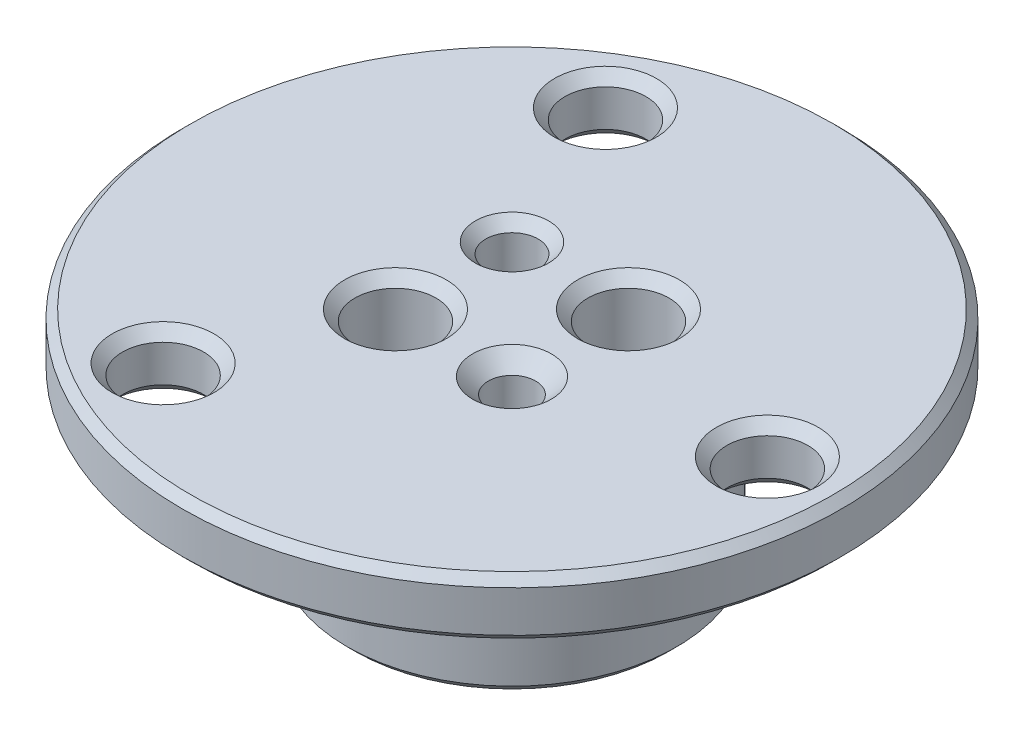
ISO-10303-21;
HEADER;
FILE_DESCRIPTION(('STEP AP214'),'2;1');
FILE_NAME('part.step','',(''),(''),'','','');
FILE_SCHEMA(('AUTOMOTIVE_DESIGN { 1 0 10303 214 1 1 1 1 }'));
ENDSEC;
DATA;
#1=APPLICATION_CONTEXT('core data for automotive mechanical design processes');
#2=APPLICATION_PROTOCOL_DEFINITION('international standard','automotive_design',2000,#1);
#3=PRODUCT_CONTEXT('',#1,'mechanical');
#4=PRODUCT('Part','Part','',(#3));
#5=PRODUCT_RELATED_PRODUCT_CATEGORY('part','',(#4));
#6=PRODUCT_DEFINITION_FORMATION('','',#4);
#7=PRODUCT_DEFINITION_CONTEXT('part definition',#1,'design');
#8=PRODUCT_DEFINITION('design','',#6,#7);
#9=PRODUCT_DEFINITION_SHAPE('','',#8);
#10=(LENGTH_UNIT() NAMED_UNIT(*) SI_UNIT(.MILLI.,.METRE.));
#11=(NAMED_UNIT(*) PLANE_ANGLE_UNIT() SI_UNIT($,.RADIAN.));
#12=(NAMED_UNIT(*) SI_UNIT($,.STERADIAN.) SOLID_ANGLE_UNIT());
#13=UNCERTAINTY_MEASURE_WITH_UNIT(LENGTH_MEASURE(1.E-05),#10,'distance_accuracy_value','');
#14=(GEOMETRIC_REPRESENTATION_CONTEXT(3) GLOBAL_UNCERTAINTY_ASSIGNED_CONTEXT((#13)) GLOBAL_UNIT_ASSIGNED_CONTEXT((#10,
#11,#12)) REPRESENTATION_CONTEXT('',''));
#15=CARTESIAN_POINT('',(0.,0.,0.));
#16=DIRECTION('',(0.,0.,1.));
#17=DIRECTION('',(1.,0.,0.));
#18=AXIS2_PLACEMENT_3D('',#15,#16,#17);
#19=CARTESIAN_POINT('',(0.,0.,-10.));
#20=DIRECTION('',(0.,1.,0.));
#21=DIRECTION('',(0.,0.,1.));
#22=AXIS2_PLACEMENT_3D('',#19,#20,#21);
#23=PLANE('',#22);
#24=CARTESIAN_POINT('',(0.,0.,0.));
#25=DIRECTION('',(0.,1.,0.));
#26=DIRECTION('',(0.,0.,1.));
#27=AXIS2_PLACEMENT_3D('',#24,#25,#26);
#28=CIRCLE('',#27,9.5);
#29=CARTESIAN_POINT('',(0.,0.,9.5));
#30=VERTEX_POINT('',#29);
#31=EDGE_CURVE('E58',#30,#30,#28,.F.);
#32=ORIENTED_EDGE('',*,*,#31,.T.);
#33=EDGE_LOOP('',(#32));
#34=FACE_BOUND('',#33,.T.);
#35=CARTESIAN_POINT('',(3.53553390593274,0.,3.53553390593274));
#36=DIRECTION('',(0.,1.,0.));
#37=DIRECTION('',(0.,0.,1.));
#38=AXIS2_PLACEMENT_3D('',#35,#36,#37);
#39=CIRCLE('',#38,2.3876);
#40=CARTESIAN_POINT('',(3.53553390593274,0.,5.92313390593274));
#41=VERTEX_POINT('',#40);
#42=EDGE_CURVE('E136',#41,#41,#39,.T.);
#43=ORIENTED_EDGE('',*,*,#42,.T.);
#44=EDGE_LOOP('',(#43));
#45=FACE_BOUND('',#44,.T.);
#46=CARTESIAN_POINT('',(-3.53553390593274,0.,-3.53553390593274));
#47=DIRECTION('',(0.,1.,0.));
#48=DIRECTION('',(0.,0.,1.));
#49=AXIS2_PLACEMENT_3D('',#46,#47,#48);
#50=CIRCLE('',#49,2.2225);
#51=CARTESIAN_POINT('',(-3.53553390593274,0.,-1.31303390593274));
#52=VERTEX_POINT('',#51);
#53=EDGE_CURVE('E88',#52,#52,#50,.T.);
#54=ORIENTED_EDGE('',*,*,#53,.T.);
#55=EDGE_LOOP('',(#54));
#56=FACE_BOUND('',#55,.T.);
#57=CARTESIAN_POINT('',(3.53553390593274,0.,-3.53553390593274));
#58=DIRECTION('',(0.,1.,0.));
#59=DIRECTION('',(0.,0.,1.));
#60=AXIS2_PLACEMENT_3D('',#57,#58,#59);
#61=CIRCLE('',#60,3.09245);
#62=CARTESIAN_POINT('',(3.53553390593274,0.,-0.443083905932741));
#63=VERTEX_POINT('',#62);
#64=EDGE_CURVE('E76',#63,#63,#61,.T.);
#65=ORIENTED_EDGE('',*,*,#64,.T.);
#66=EDGE_LOOP('',(#65));
#67=FACE_BOUND('',#66,.T.);
#68=CARTESIAN_POINT('',(-3.53553390593274,0.,3.53553390593274));
#69=DIRECTION('',(0.,1.,0.));
#70=DIRECTION('',(0.,0.,1.));
#71=AXIS2_PLACEMENT_3D('',#68,#69,#70);
#72=CIRCLE('',#71,3.09245);
#73=CARTESIAN_POINT('',(-3.53553390593274,0.,6.62798390593274));
#74=VERTEX_POINT('',#73);
#75=EDGE_CURVE('E64',#74,#74,#72,.T.);
#76=ORIENTED_EDGE('',*,*,#75,.T.);
#77=EDGE_LOOP('',(#76));
#78=FACE_BOUND('',#77,.T.);
#79=ADVANCED_FACE('F32',(#34,#45,#56,#67,#78),#23,.F.);
#80=CARTESIAN_POINT('',(0.,13.2432806,0.));
#81=DIRECTION('',(0.,-1.,0.));
#82=DIRECTION('',(0.,0.,-1.));
#83=AXIS2_PLACEMENT_3D('',#80,#81,#82);
#84=PLANE('',#83);
#85=CARTESIAN_POINT('',(0.,13.2432806,0.));
#86=DIRECTION('',(0.,-1.,0.));
#87=DIRECTION('',(0.,0.,-1.));
#88=AXIS2_PLACEMENT_3D('',#85,#86,#87);
#89=CIRCLE('',#88,19.5);
#90=CARTESIAN_POINT('',(0.,13.2432806,-19.5));
#91=VERTEX_POINT('',#90);
#92=EDGE_CURVE('E43',#91,#91,#89,.F.);
#93=ORIENTED_EDGE('',*,*,#92,.T.);
#94=EDGE_LOOP('',(#93));
#95=FACE_BOUND('',#94,.T.);
#96=CARTESIAN_POINT('',(3.53553390593274,13.2432806,3.53553390593274));
#97=DIRECTION('',(0.,1.,0.));
#98=DIRECTION('',(0.,0.,1.));
#99=AXIS2_PLACEMENT_3D('',#96,#97,#98);
#100=CIRCLE('',#99,2.3876);
#101=CARTESIAN_POINT('',(3.53553390593274,13.2432806,5.92313390593274));
#102=VERTEX_POINT('',#101);
#103=EDGE_CURVE('E145',#102,#102,#100,.T.);
#104=ORIENTED_EDGE('',*,*,#103,.F.);
#105=EDGE_LOOP('',(#104));
#106=FACE_BOUND('',#105,.T.);
#107=CARTESIAN_POINT('',(-7.75000000000006,13.2432806,-13.4233937586588));
#108=DIRECTION('',(0.,1.,0.));
#109=DIRECTION('',(0.,0.,1.));
#110=AXIS2_PLACEMENT_3D('',#107,#108,#109);
#111=CIRCLE('',#110,3.09245);
#112=CARTESIAN_POINT('',(-7.75000000000006,13.2432806,-10.3309437586588));
#113=VERTEX_POINT('',#112);
#114=EDGE_CURVE('E133',#113,#113,#111,.T.);
#115=ORIENTED_EDGE('',*,*,#114,.F.);
#116=EDGE_LOOP('',(#115));
#117=FACE_BOUND('',#116,.T.);
#118=CARTESIAN_POINT('',(15.5,13.2432806,0.));
#119=DIRECTION('',(0.,1.,0.));
#120=DIRECTION('',(0.,0.,1.));
#121=AXIS2_PLACEMENT_3D('',#118,#119,#120);
#122=CIRCLE('',#121,3.09245);
#123=CARTESIAN_POINT('',(15.5,13.2432806,3.09245));
#124=VERTEX_POINT('',#123);
#125=EDGE_CURVE('E121',#124,#124,#122,.T.);
#126=ORIENTED_EDGE('',*,*,#125,.F.);
#127=EDGE_LOOP('',(#126));
#128=FACE_BOUND('',#127,.T.);
#129=CARTESIAN_POINT('',(-7.75000000000006,13.2432806,13.4233937586588));
#130=DIRECTION('',(0.,1.,0.));
#131=DIRECTION('',(0.,0.,1.));
#132=AXIS2_PLACEMENT_3D('',#129,#130,#131);
#133=CIRCLE('',#132,3.09245);
#134=CARTESIAN_POINT('',(-7.75000000000006,13.2432806,16.5158437586588));
#135=VERTEX_POINT('',#134);
#136=EDGE_CURVE('E109',#135,#135,#133,.T.);
#137=ORIENTED_EDGE('',*,*,#136,.F.);
#138=EDGE_LOOP('',(#137));
#139=FACE_BOUND('',#138,.T.);
#140=CARTESIAN_POINT('',(-3.53553390593274,13.2432806,-3.53553390593274));
#141=DIRECTION('',(0.,1.,0.));
#142=DIRECTION('',(0.,0.,1.));
#143=AXIS2_PLACEMENT_3D('',#140,#141,#142);
#144=CIRCLE('',#143,2.2225);
#145=CARTESIAN_POINT('',(-3.53553390593274,13.2432806,-1.31303390593274));
#146=VERTEX_POINT('',#145);
#147=EDGE_CURVE('E97',#146,#146,#144,.T.);
#148=ORIENTED_EDGE('',*,*,#147,.F.);
#149=EDGE_LOOP('',(#148));
#150=FACE_BOUND('',#149,.T.);
#151=CARTESIAN_POINT('',(3.53553390593274,13.2432806,-3.53553390593274));
#152=DIRECTION('',(0.,1.,0.));
#153=DIRECTION('',(0.,0.,1.));
#154=AXIS2_PLACEMENT_3D('',#151,#152,#153);
#155=CIRCLE('',#154,3.09245);
#156=CARTESIAN_POINT('',(3.53553390593274,13.2432806,-0.443083905932738));
#157=VERTEX_POINT('',#156);
#158=EDGE_CURVE('E85',#157,#157,#155,.T.);
#159=ORIENTED_EDGE('',*,*,#158,.F.);
#160=EDGE_LOOP('',(#159));
#161=FACE_BOUND('',#160,.T.);
#162=CARTESIAN_POINT('',(-3.53553390593274,13.2432806,3.53553390593274));
#163=DIRECTION('',(0.,1.,0.));
#164=DIRECTION('',(0.,0.,1.));
#165=AXIS2_PLACEMENT_3D('',#162,#163,#164);
#166=CIRCLE('',#165,3.09245);
#167=CARTESIAN_POINT('',(-3.53553390593274,13.2432806,6.62798390593274));
#168=VERTEX_POINT('',#167);
#169=EDGE_CURVE('E73',#168,#168,#166,.T.);
#170=ORIENTED_EDGE('',*,*,#169,.F.);
#171=EDGE_LOOP('',(#170));
#172=FACE_BOUND('',#171,.T.);
#173=ADVANCED_FACE('F151',(#95,#106,#117,#128,#139,#150,#161,#172),#84,.F.);
#174=CARTESIAN_POINT('',(0.,0.,0.));
#175=DIRECTION('',(0.,1.,0.));
#176=DIRECTION('',(0.,0.,1.));
#177=AXIS2_PLACEMENT_3D('',#174,#175,#176);
#178=CYLINDRICAL_SURFACE('',#177,20.);
#179=CARTESIAN_POINT('',(0.,10.2432806,0.));
#180=DIRECTION('',(0.,1.,0.));
#181=DIRECTION('',(0.,0.,1.));
#182=AXIS2_PLACEMENT_3D('',#179,#180,#181);
#183=CIRCLE('',#182,20.);
#184=CARTESIAN_POINT('',(0.,10.2432806,20.));
#185=VERTEX_POINT('',#184);
#186=EDGE_CURVE('E52',#185,#185,#183,.T.);
#187=ORIENTED_EDGE('',*,*,#186,.T.);
#188=EDGE_LOOP('',(#187));
#189=FACE_BOUND('',#188,.T.);
#190=CARTESIAN_POINT('',(0.,12.7432806,0.));
#191=DIRECTION('',(0.,-1.,0.));
#192=DIRECTION('',(0.,0.,-1.));
#193=AXIS2_PLACEMENT_3D('',#190,#191,#192);
#194=CIRCLE('',#193,20.);
#195=CARTESIAN_POINT('',(0.,12.7432806,-20.));
#196=VERTEX_POINT('',#195);
#197=EDGE_CURVE('E55',#196,#196,#194,.T.);
#198=ORIENTED_EDGE('',*,*,#197,.T.);
#199=EDGE_LOOP('',(#198));
#200=FACE_BOUND('',#199,.T.);
#201=ADVANCED_FACE('F154',(#189,#200),#178,.T.);
#202=CARTESIAN_POINT('',(0.,9.7432806,-20.));
#203=DIRECTION('',(0.,1.,0.));
#204=DIRECTION('',(0.,0.,1.));
#205=AXIS2_PLACEMENT_3D('',#202,#203,#204);
#206=PLANE('',#205);
#207=CARTESIAN_POINT('',(0.,9.7432806,0.));
#208=DIRECTION('',(0.,1.,0.));
#209=DIRECTION('',(0.,0.,1.));
#210=AXIS2_PLACEMENT_3D('',#207,#208,#209);
#211=CIRCLE('',#210,10.5);
#212=CARTESIAN_POINT('',(0.,9.7432806,10.5));
#213=VERTEX_POINT('',#212);
#214=EDGE_CURVE('E39',#213,#213,#211,.T.);
#215=ORIENTED_EDGE('',*,*,#214,.T.);
#216=EDGE_LOOP('',(#215));
#217=FACE_BOUND('',#216,.T.);
#218=CARTESIAN_POINT('',(0.,9.7432806,0.));
#219=DIRECTION('',(0.,1.,0.));
#220=DIRECTION('',(0.,0.,1.));
#221=AXIS2_PLACEMENT_3D('',#218,#219,#220);
#222=CIRCLE('',#221,19.5);
#223=CARTESIAN_POINT('',(0.,9.7432806,19.5));
#224=VERTEX_POINT('',#223);
#225=EDGE_CURVE('E47',#224,#224,#222,.F.);
#226=ORIENTED_EDGE('',*,*,#225,.T.);
#227=EDGE_LOOP('',(#226));
#228=FACE_BOUND('',#227,.T.);
#229=CARTESIAN_POINT('',(-7.75000000000006,9.7432806,-13.4233937586588));
#230=DIRECTION('',(0.,1.,0.));
#231=DIRECTION('',(0.,0.,1.));
#232=AXIS2_PLACEMENT_3D('',#229,#230,#231);
#233=CIRCLE('',#232,3.0861);
#234=CARTESIAN_POINT('',(-7.75000000000006,9.7432806,-10.3372937586588));
#235=VERTEX_POINT('',#234);
#236=EDGE_CURVE('E124',#235,#235,#233,.T.);
#237=ORIENTED_EDGE('',*,*,#236,.T.);
#238=EDGE_LOOP('',(#237));
#239=FACE_BOUND('',#238,.T.);
#240=CARTESIAN_POINT('',(15.5,9.7432806,0.));
#241=DIRECTION('',(0.,1.,0.));
#242=DIRECTION('',(0.,0.,1.));
#243=AXIS2_PLACEMENT_3D('',#240,#241,#242);
#244=CIRCLE('',#243,3.0861);
#245=CARTESIAN_POINT('',(15.5,9.7432806,3.0861));
#246=VERTEX_POINT('',#245);
#247=EDGE_CURVE('E112',#246,#246,#244,.T.);
#248=ORIENTED_EDGE('',*,*,#247,.T.);
#249=EDGE_LOOP('',(#248));
#250=FACE_BOUND('',#249,.T.);
#251=CARTESIAN_POINT('',(-7.75000000000006,9.7432806,13.4233937586588));
#252=DIRECTION('',(0.,1.,0.));
#253=DIRECTION('',(0.,0.,1.));
#254=AXIS2_PLACEMENT_3D('',#251,#252,#253);
#255=CIRCLE('',#254,3.0861);
#256=CARTESIAN_POINT('',(-7.75000000000006,9.7432806,16.5094937586588));
#257=VERTEX_POINT('',#256);
#258=EDGE_CURVE('E100',#257,#257,#255,.T.);
#259=ORIENTED_EDGE('',*,*,#258,.T.);
#260=EDGE_LOOP('',(#259));
#261=FACE_BOUND('',#260,.T.);
#262=ADVANCED_FACE('F213',(#217,#228,#239,#250,#261),#206,.F.);
#263=CARTESIAN_POINT('',(0.,0.,0.));
#264=DIRECTION('',(0.,1.,0.));
#265=DIRECTION('',(0.,0.,1.));
#266=AXIS2_PLACEMENT_3D('',#263,#264,#265);
#267=CYLINDRICAL_SURFACE('',#266,10.);
#268=CARTESIAN_POINT('',(0.,9.2432806,0.));
#269=DIRECTION('',(0.,1.,0.));
#270=DIRECTION('',(0.,0.,1.));
#271=AXIS2_PLACEMENT_3D('',#268,#269,#270);
#272=CIRCLE('',#271,10.);
#273=CARTESIAN_POINT('',(0.,9.2432806,10.));
#274=VERTEX_POINT('',#273);
#275=EDGE_CURVE('E10',#274,#274,#272,.F.);
#276=ORIENTED_EDGE('',*,*,#275,.T.);
#277=EDGE_LOOP('',(#276));
#278=FACE_BOUND('',#277,.T.);
#279=CARTESIAN_POINT('',(0.,0.499999999999991,0.));
#280=DIRECTION('',(0.,1.,0.));
#281=DIRECTION('',(0.,0.,1.));
#282=AXIS2_PLACEMENT_3D('',#279,#280,#281);
#283=CIRCLE('',#282,10.);
#284=CARTESIAN_POINT('',(0.,0.499999999999991,10.));
#285=VERTEX_POINT('',#284);
#286=EDGE_CURVE('E61',#285,#285,#283,.T.);
#287=ORIENTED_EDGE('',*,*,#286,.T.);
#288=EDGE_LOOP('',(#287));
#289=FACE_BOUND('',#288,.T.);
#290=ADVANCED_FACE('F218',(#278,#289),#267,.T.);
#291=CARTESIAN_POINT('',(-3.53553390593274,0.634999999999997,3.53553390593274));
#292=DIRECTION('',(0.,-1.,0.));
#293=DIRECTION('',(0.,0.,-1.));
#294=AXIS2_PLACEMENT_3D('',#291,#292,#293);
#295=CONICAL_SURFACE('',#294,2.45745,0.785398163397451);
#296=ORIENTED_EDGE('',*,*,#75,.F.);
#297=EDGE_LOOP('',(#296));
#298=FACE_BOUND('',#297,.T.);
#299=CARTESIAN_POINT('',(-3.53553390593274,0.634999999999997,3.53553390593274));
#300=DIRECTION('',(0.,1.,0.));
#301=DIRECTION('',(0.,0.,1.));
#302=AXIS2_PLACEMENT_3D('',#299,#300,#301);
#303=CIRCLE('',#302,2.45745);
#304=CARTESIAN_POINT('',(-3.53553390593274,0.634999999999997,5.99298390593274));
#305=VERTEX_POINT('',#304);
#306=EDGE_CURVE('E67',#305,#305,#303,.T.);
#307=ORIENTED_EDGE('',*,*,#306,.T.);
#308=EDGE_LOOP('',(#307));
#309=FACE_BOUND('',#308,.T.);
#310=ADVANCED_FACE('F182',(#298,#309),#295,.F.);
#311=CARTESIAN_POINT('',(-3.53553390593274,13.2432806,3.53553390593274));
#312=DIRECTION('',(0.,1.,0.));
#313=DIRECTION('',(0.,0.,1.));
#314=AXIS2_PLACEMENT_3D('',#311,#312,#313);
#315=CYLINDRICAL_SURFACE('',#314,2.45744999999999);
#316=ORIENTED_EDGE('',*,*,#306,.F.);
#317=EDGE_LOOP('',(#316));
#318=FACE_BOUND('',#317,.T.);
#319=CARTESIAN_POINT('',(-3.53553390593274,12.6082806,3.53553390593274));
#320=DIRECTION('',(0.,1.,0.));
#321=DIRECTION('',(0.,0.,1.));
#322=AXIS2_PLACEMENT_3D('',#319,#320,#321);
#323=CIRCLE('',#322,2.45744999999999);
#324=CARTESIAN_POINT('',(-3.53553390593274,12.6082806,5.99298390593273));
#325=VERTEX_POINT('',#324);
#326=EDGE_CURVE('E70',#325,#325,#323,.T.);
#327=ORIENTED_EDGE('',*,*,#326,.T.);
#328=EDGE_LOOP('',(#327));
#329=FACE_BOUND('',#328,.T.);
#330=ADVANCED_FACE('F172',(#318,#329),#315,.F.);
#331=CARTESIAN_POINT('',(-3.53553390593274,13.2432806,3.53553390593274));
#332=DIRECTION('',(0.,1.,0.));
#333=DIRECTION('',(0.,0.,1.));
#334=AXIS2_PLACEMENT_3D('',#331,#332,#333);
#335=CONICAL_SURFACE('',#334,3.09245,0.785398163397448);
#336=ORIENTED_EDGE('',*,*,#326,.F.);
#337=EDGE_LOOP('',(#336));
#338=FACE_BOUND('',#337,.T.);
#339=ORIENTED_EDGE('',*,*,#169,.T.);
#340=EDGE_LOOP('',(#339));
#341=FACE_BOUND('',#340,.T.);
#342=ADVANCED_FACE('F169',(#338,#341),#335,.F.);
#343=CARTESIAN_POINT('',(3.53553390593274,0.634999999999997,-3.53553390593274));
#344=DIRECTION('',(0.,-1.,0.));
#345=DIRECTION('',(0.,0.,-1.));
#346=AXIS2_PLACEMENT_3D('',#343,#344,#345);
#347=CONICAL_SURFACE('',#346,2.45745,0.785398163397451);
#348=ORIENTED_EDGE('',*,*,#64,.F.);
#349=EDGE_LOOP('',(#348));
#350=FACE_BOUND('',#349,.T.);
#351=CARTESIAN_POINT('',(3.53553390593274,0.634999999999997,-3.53553390593274));
#352=DIRECTION('',(0.,1.,0.));
#353=DIRECTION('',(0.,0.,1.));
#354=AXIS2_PLACEMENT_3D('',#351,#352,#353);
#355=CIRCLE('',#354,2.45745);
#356=CARTESIAN_POINT('',(3.53553390593274,0.634999999999997,-1.07808390593274));
#357=VERTEX_POINT('',#356);
#358=EDGE_CURVE('E79',#357,#357,#355,.T.);
#359=ORIENTED_EDGE('',*,*,#358,.T.);
#360=EDGE_LOOP('',(#359));
#361=FACE_BOUND('',#360,.T.);
#362=ADVANCED_FACE('F171',(#350,#361),#347,.F.);
#363=CARTESIAN_POINT('',(3.53553390593274,13.2432806,-3.53553390593274));
#364=DIRECTION('',(0.,1.,0.));
#365=DIRECTION('',(0.,0.,1.));
#366=AXIS2_PLACEMENT_3D('',#363,#364,#365);
#367=CYLINDRICAL_SURFACE('',#366,2.45744999999999);
#368=ORIENTED_EDGE('',*,*,#358,.F.);
#369=EDGE_LOOP('',(#368));
#370=FACE_BOUND('',#369,.T.);
#371=CARTESIAN_POINT('',(3.53553390593274,12.6082806,-3.53553390593274));
#372=DIRECTION('',(0.,1.,0.));
#373=DIRECTION('',(0.,0.,1.));
#374=AXIS2_PLACEMENT_3D('',#371,#372,#373);
#375=CIRCLE('',#374,2.45744999999999);
#376=CARTESIAN_POINT('',(3.53553390593274,12.6082806,-1.07808390593275));
#377=VERTEX_POINT('',#376);
#378=EDGE_CURVE('E82',#377,#377,#375,.T.);
#379=ORIENTED_EDGE('',*,*,#378,.T.);
#380=EDGE_LOOP('',(#379));
#381=FACE_BOUND('',#380,.T.);
#382=ADVANCED_FACE('F179',(#370,#381),#367,.F.);
#383=CARTESIAN_POINT('',(3.53553390593274,13.2432806,-3.53553390593274));
#384=DIRECTION('',(0.,1.,0.));
#385=DIRECTION('',(0.,0.,1.));
#386=AXIS2_PLACEMENT_3D('',#383,#384,#385);
#387=CONICAL_SURFACE('',#386,3.09245,0.785398163397448);
#388=ORIENTED_EDGE('',*,*,#378,.F.);
#389=EDGE_LOOP('',(#388));
#390=FACE_BOUND('',#389,.T.);
#391=ORIENTED_EDGE('',*,*,#158,.T.);
#392=EDGE_LOOP('',(#391));
#393=FACE_BOUND('',#392,.T.);
#394=ADVANCED_FACE('F257',(#390,#393),#387,.F.);
#395=CARTESIAN_POINT('',(-3.53553390593274,0.635000000000005,-3.53553390593274));
#396=DIRECTION('',(0.,-1.,0.));
#397=DIRECTION('',(0.,0.,-1.));
#398=AXIS2_PLACEMENT_3D('',#395,#396,#397);
#399=CONICAL_SURFACE('',#398,1.5875,0.785398163397444);
#400=ORIENTED_EDGE('',*,*,#53,.F.);
#401=EDGE_LOOP('',(#400));
#402=FACE_BOUND('',#401,.T.);
#403=CARTESIAN_POINT('',(-3.53553390593274,0.635000000000005,-3.53553390593274));
#404=DIRECTION('',(0.,1.,0.));
#405=DIRECTION('',(0.,0.,1.));
#406=AXIS2_PLACEMENT_3D('',#403,#404,#405);
#407=CIRCLE('',#406,1.5875);
#408=CARTESIAN_POINT('',(-3.53553390593274,0.635000000000005,-1.94803390593274));
#409=VERTEX_POINT('',#408);
#410=EDGE_CURVE('E91',#409,#409,#407,.T.);
#411=ORIENTED_EDGE('',*,*,#410,.T.);
#412=EDGE_LOOP('',(#411));
#413=FACE_BOUND('',#412,.T.);
#414=ADVANCED_FACE('F267',(#402,#413),#399,.F.);
#415=CARTESIAN_POINT('',(-3.53553390593274,13.2432806,-3.53553390593274));
#416=DIRECTION('',(0.,1.,0.));
#417=DIRECTION('',(0.,0.,1.));
#418=AXIS2_PLACEMENT_3D('',#415,#416,#417);
#419=CYLINDRICAL_SURFACE('',#418,1.5875);
#420=ORIENTED_EDGE('',*,*,#410,.F.);
#421=EDGE_LOOP('',(#420));
#422=FACE_BOUND('',#421,.T.);
#423=CARTESIAN_POINT('',(-3.53553390593274,12.6082806,-3.53553390593274));
#424=DIRECTION('',(0.,1.,0.));
#425=DIRECTION('',(0.,0.,1.));
#426=AXIS2_PLACEMENT_3D('',#423,#424,#425);
#427=CIRCLE('',#426,1.5875);
#428=CARTESIAN_POINT('',(-3.53553390593274,12.6082806,-1.94803390593274));
#429=VERTEX_POINT('',#428);
#430=EDGE_CURVE('E94',#429,#429,#427,.T.);
#431=ORIENTED_EDGE('',*,*,#430,.T.);
#432=EDGE_LOOP('',(#431));
#433=FACE_BOUND('',#432,.T.);
#434=ADVANCED_FACE('F277',(#422,#433),#419,.F.);
#435=CARTESIAN_POINT('',(-3.53553390593274,13.2432806,-3.53553390593274));
#436=DIRECTION('',(0.,1.,0.));
#437=DIRECTION('',(0.,0.,1.));
#438=AXIS2_PLACEMENT_3D('',#435,#436,#437);
#439=CONICAL_SURFACE('',#438,2.2225,0.785398163397448);
#440=ORIENTED_EDGE('',*,*,#430,.F.);
#441=EDGE_LOOP('',(#440));
#442=FACE_BOUND('',#441,.T.);
#443=ORIENTED_EDGE('',*,*,#147,.T.);
#444=EDGE_LOOP('',(#443));
#445=FACE_BOUND('',#444,.T.);
#446=ADVANCED_FACE('F287',(#442,#445),#439,.F.);
#447=CARTESIAN_POINT('',(-7.75000000000006,10.3719306,13.4233937586588));
#448=DIRECTION('',(0.,-1.,0.));
#449=DIRECTION('',(0.,0.,-1.));
#450=AXIS2_PLACEMENT_3D('',#447,#448,#449);
#451=CONICAL_SURFACE('',#450,2.45745,0.785398163397448);
#452=ORIENTED_EDGE('',*,*,#258,.F.);
#453=EDGE_LOOP('',(#452));
#454=FACE_BOUND('',#453,.T.);
#455=CARTESIAN_POINT('',(-7.75000000000006,10.3719306,13.4233937586588));
#456=DIRECTION('',(0.,1.,0.));
#457=DIRECTION('',(0.,0.,1.));
#458=AXIS2_PLACEMENT_3D('',#455,#456,#457);
#459=CIRCLE('',#458,2.45745);
#460=CARTESIAN_POINT('',(-7.75000000000006,10.3719306,15.8808437586588));
#461=VERTEX_POINT('',#460);
#462=EDGE_CURVE('E103',#461,#461,#459,.T.);
#463=ORIENTED_EDGE('',*,*,#462,.T.);
#464=EDGE_LOOP('',(#463));
#465=FACE_BOUND('',#464,.T.);
#466=ADVANCED_FACE('F297',(#454,#465),#451,.F.);
#467=CARTESIAN_POINT('',(-7.75000000000006,13.2432806,13.4233937586588));
#468=DIRECTION('',(0.,1.,0.));
#469=DIRECTION('',(0.,0.,1.));
#470=AXIS2_PLACEMENT_3D('',#467,#468,#469);
#471=CYLINDRICAL_SURFACE('',#470,2.45744999999999);
#472=ORIENTED_EDGE('',*,*,#462,.F.);
#473=EDGE_LOOP('',(#472));
#474=FACE_BOUND('',#473,.T.);
#475=CARTESIAN_POINT('',(-7.75000000000006,12.6082806,13.4233937586588));
#476=DIRECTION('',(0.,1.,0.));
#477=DIRECTION('',(0.,0.,1.));
#478=AXIS2_PLACEMENT_3D('',#475,#476,#477);
#479=CIRCLE('',#478,2.45744999999999);
#480=CARTESIAN_POINT('',(-7.75000000000006,12.6082806,15.8808437586587));
#481=VERTEX_POINT('',#480);
#482=EDGE_CURVE('E106',#481,#481,#479,.T.);
#483=ORIENTED_EDGE('',*,*,#482,.T.);
#484=EDGE_LOOP('',(#483));
#485=FACE_BOUND('',#484,.T.);
#486=ADVANCED_FACE('F307',(#474,#485),#471,.F.);
#487=CARTESIAN_POINT('',(-7.75000000000006,13.2432806,13.4233937586588));
#488=DIRECTION('',(0.,1.,0.));
#489=DIRECTION('',(0.,0.,1.));
#490=AXIS2_PLACEMENT_3D('',#487,#488,#489);
#491=CONICAL_SURFACE('',#490,3.09245,0.785398163397448);
#492=ORIENTED_EDGE('',*,*,#482,.F.);
#493=EDGE_LOOP('',(#492));
#494=FACE_BOUND('',#493,.T.);
#495=ORIENTED_EDGE('',*,*,#136,.T.);
#496=EDGE_LOOP('',(#495));
#497=FACE_BOUND('',#496,.T.);
#498=ADVANCED_FACE('F317',(#494,#497),#491,.F.);
#499=CARTESIAN_POINT('',(15.5,10.3719306,0.));
#500=DIRECTION('',(0.,-1.,0.));
#501=DIRECTION('',(0.,0.,-1.));
#502=AXIS2_PLACEMENT_3D('',#499,#500,#501);
#503=CONICAL_SURFACE('',#502,2.45745,0.785398163397447);
#504=ORIENTED_EDGE('',*,*,#247,.F.);
#505=EDGE_LOOP('',(#504));
#506=FACE_BOUND('',#505,.T.);
#507=CARTESIAN_POINT('',(15.5,10.3719306,0.));
#508=DIRECTION('',(0.,1.,0.));
#509=DIRECTION('',(0.,0.,1.));
#510=AXIS2_PLACEMENT_3D('',#507,#508,#509);
#511=CIRCLE('',#510,2.45745);
#512=CARTESIAN_POINT('',(15.5,10.3719306,2.45745));
#513=VERTEX_POINT('',#512);
#514=EDGE_CURVE('E115',#513,#513,#511,.T.);
#515=ORIENTED_EDGE('',*,*,#514,.T.);
#516=EDGE_LOOP('',(#515));
#517=FACE_BOUND('',#516,.T.);
#518=ADVANCED_FACE('F327',(#506,#517),#503,.F.);
#519=CARTESIAN_POINT('',(15.5,13.2432806,0.));
#520=DIRECTION('',(0.,1.,0.));
#521=DIRECTION('',(0.,0.,1.));
#522=AXIS2_PLACEMENT_3D('',#519,#520,#521);
#523=CYLINDRICAL_SURFACE('',#522,2.45744999999999);
#524=ORIENTED_EDGE('',*,*,#514,.F.);
#525=EDGE_LOOP('',(#524));
#526=FACE_BOUND('',#525,.T.);
#527=CARTESIAN_POINT('',(15.5,12.6082806,0.));
#528=DIRECTION('',(0.,1.,0.));
#529=DIRECTION('',(0.,0.,1.));
#530=AXIS2_PLACEMENT_3D('',#527,#528,#529);
#531=CIRCLE('',#530,2.45744999999999);
#532=CARTESIAN_POINT('',(15.5,12.6082806,2.45744999999999));
#533=VERTEX_POINT('',#532);
#534=EDGE_CURVE('E118',#533,#533,#531,.T.);
#535=ORIENTED_EDGE('',*,*,#534,.T.);
#536=EDGE_LOOP('',(#535));
#537=FACE_BOUND('',#536,.T.);
#538=ADVANCED_FACE('F337',(#526,#537),#523,.F.);
#539=CARTESIAN_POINT('',(15.5,13.2432806,0.));
#540=DIRECTION('',(0.,1.,0.));
#541=DIRECTION('',(0.,0.,1.));
#542=AXIS2_PLACEMENT_3D('',#539,#540,#541);
#543=CONICAL_SURFACE('',#542,3.09245,0.78539816339745);
#544=ORIENTED_EDGE('',*,*,#534,.F.);
#545=EDGE_LOOP('',(#544));
#546=FACE_BOUND('',#545,.T.);
#547=ORIENTED_EDGE('',*,*,#125,.T.);
#548=EDGE_LOOP('',(#547));
#549=FACE_BOUND('',#548,.T.);
#550=ADVANCED_FACE('F347',(#546,#549),#543,.F.);
#551=CARTESIAN_POINT('',(-7.75000000000006,10.3719306,-13.4233937586588));
#552=DIRECTION('',(0.,-1.,0.));
#553=DIRECTION('',(0.,0.,-1.));
#554=AXIS2_PLACEMENT_3D('',#551,#552,#553);
#555=CONICAL_SURFACE('',#554,2.45745,0.785398163397448);
#556=ORIENTED_EDGE('',*,*,#236,.F.);
#557=EDGE_LOOP('',(#556));
#558=FACE_BOUND('',#557,.T.);
#559=CARTESIAN_POINT('',(-7.75000000000006,10.3719306,-13.4233937586588));
#560=DIRECTION('',(0.,1.,0.));
#561=DIRECTION('',(0.,0.,1.));
#562=AXIS2_PLACEMENT_3D('',#559,#560,#561);
#563=CIRCLE('',#562,2.45745);
#564=CARTESIAN_POINT('',(-7.75000000000006,10.3719306,-10.9659437586588));
#565=VERTEX_POINT('',#564);
#566=EDGE_CURVE('E127',#565,#565,#563,.T.);
#567=ORIENTED_EDGE('',*,*,#566,.T.);
#568=EDGE_LOOP('',(#567));
#569=FACE_BOUND('',#568,.T.);
#570=ADVANCED_FACE('F357',(#558,#569),#555,.F.);
#571=CARTESIAN_POINT('',(-7.75000000000006,13.2432806,-13.4233937586588));
#572=DIRECTION('',(0.,1.,0.));
#573=DIRECTION('',(0.,0.,1.));
#574=AXIS2_PLACEMENT_3D('',#571,#572,#573);
#575=CYLINDRICAL_SURFACE('',#574,2.45744999999999);
#576=ORIENTED_EDGE('',*,*,#566,.F.);
#577=EDGE_LOOP('',(#576));
#578=FACE_BOUND('',#577,.T.);
#579=CARTESIAN_POINT('',(-7.75000000000006,12.6082806,-13.4233937586588));
#580=DIRECTION('',(0.,1.,0.));
#581=DIRECTION('',(0.,0.,1.));
#582=AXIS2_PLACEMENT_3D('',#579,#580,#581);
#583=CIRCLE('',#582,2.45744999999999);
#584=CARTESIAN_POINT('',(-7.75000000000006,12.6082806,-10.9659437586588));
#585=VERTEX_POINT('',#584);
#586=EDGE_CURVE('E130',#585,#585,#583,.T.);
#587=ORIENTED_EDGE('',*,*,#586,.T.);
#588=EDGE_LOOP('',(#587));
#589=FACE_BOUND('',#588,.T.);
#590=ADVANCED_FACE('F367',(#578,#589),#575,.F.);
#591=CARTESIAN_POINT('',(-7.75000000000006,13.2432806,-13.4233937586588));
#592=DIRECTION('',(0.,1.,0.));
#593=DIRECTION('',(0.,0.,1.));
#594=AXIS2_PLACEMENT_3D('',#591,#592,#593);
#595=CONICAL_SURFACE('',#594,3.09245,0.785398163397448);
#596=ORIENTED_EDGE('',*,*,#586,.F.);
#597=EDGE_LOOP('',(#596));
#598=FACE_BOUND('',#597,.T.);
#599=ORIENTED_EDGE('',*,*,#114,.T.);
#600=EDGE_LOOP('',(#599));
#601=FACE_BOUND('',#600,.T.);
#602=ADVANCED_FACE('F377',(#598,#601),#595,.F.);
#603=CARTESIAN_POINT('',(3.53553390593274,0.952499999999998,3.53553390593274));
#604=DIRECTION('',(0.,-1.,0.));
#605=DIRECTION('',(0.,0.,-1.));
#606=AXIS2_PLACEMENT_3D('',#603,#604,#605);
#607=CONICAL_SURFACE('',#606,1.4351,0.785398163397449);
#608=ORIENTED_EDGE('',*,*,#42,.F.);
#609=EDGE_LOOP('',(#608));
#610=FACE_BOUND('',#609,.T.);
#611=CARTESIAN_POINT('',(3.53553390593274,0.952499999999998,3.53553390593274));
#612=DIRECTION('',(0.,1.,0.));
#613=DIRECTION('',(0.,0.,1.));
#614=AXIS2_PLACEMENT_3D('',#611,#612,#613);
#615=CIRCLE('',#614,1.4351);
#616=CARTESIAN_POINT('',(3.53553390593274,0.952499999999998,4.97063390593274));
#617=VERTEX_POINT('',#616);
#618=EDGE_CURVE('E139',#617,#617,#615,.T.);
#619=ORIENTED_EDGE('',*,*,#618,.T.);
#620=EDGE_LOOP('',(#619));
#621=FACE_BOUND('',#620,.T.);
#622=ADVANCED_FACE('F387',(#610,#621),#607,.F.);
#623=CARTESIAN_POINT('',(3.53553390593274,13.2432806,3.53553390593274));
#624=DIRECTION('',(0.,1.,0.));
#625=DIRECTION('',(0.,0.,1.));
#626=AXIS2_PLACEMENT_3D('',#623,#624,#625);
#627=CYLINDRICAL_SURFACE('',#626,1.4351);
#628=ORIENTED_EDGE('',*,*,#618,.F.);
#629=EDGE_LOOP('',(#628));
#630=FACE_BOUND('',#629,.T.);
#631=CARTESIAN_POINT('',(3.53553390593274,12.2907806,3.53553390593274));
#632=DIRECTION('',(0.,1.,0.));
#633=DIRECTION('',(0.,0.,1.));
#634=AXIS2_PLACEMENT_3D('',#631,#632,#633);
#635=CIRCLE('',#634,1.4351);
#636=CARTESIAN_POINT('',(3.53553390593274,12.2907806,4.97063390593274));
#637=VERTEX_POINT('',#636);
#638=EDGE_CURVE('E142',#637,#637,#635,.T.);
#639=ORIENTED_EDGE('',*,*,#638,.T.);
#640=EDGE_LOOP('',(#639));
#641=FACE_BOUND('',#640,.T.);
#642=ADVANCED_FACE('F397',(#630,#641),#627,.F.);
#643=CARTESIAN_POINT('',(3.53553390593274,13.2432806,3.53553390593274));
#644=DIRECTION('',(0.,1.,0.));
#645=DIRECTION('',(0.,0.,1.));
#646=AXIS2_PLACEMENT_3D('',#643,#644,#645);
#647=CONICAL_SURFACE('',#646,2.3876,0.785398163397447);
#648=ORIENTED_EDGE('',*,*,#638,.F.);
#649=EDGE_LOOP('',(#648));
#650=FACE_BOUND('',#649,.T.);
#651=ORIENTED_EDGE('',*,*,#103,.T.);
#652=EDGE_LOOP('',(#651));
#653=FACE_BOUND('',#652,.T.);
#654=ADVANCED_FACE('F149',(#650,#653),#647,.F.);
#655=CARTESIAN_POINT('',(0.,0.499999999999991,0.));
#656=DIRECTION('',(0.,1.,0.));
#657=DIRECTION('',(0.,0.,1.));
#658=AXIS2_PLACEMENT_3D('',#655,#656,#657);
#659=CONICAL_SURFACE('',#658,10.,0.785398163397453);
#660=ORIENTED_EDGE('',*,*,#31,.F.);
#661=EDGE_LOOP('',(#660));
#662=FACE_BOUND('',#661,.T.);
#663=ORIENTED_EDGE('',*,*,#286,.F.);
#664=EDGE_LOOP('',(#663));
#665=FACE_BOUND('',#664,.T.);
#666=ADVANCED_FACE('F194',(#662,#665),#659,.T.);
#667=CARTESIAN_POINT('',(0.,10.2432806,0.));
#668=DIRECTION('',(0.,1.,0.));
#669=DIRECTION('',(0.,0.,1.));
#670=AXIS2_PLACEMENT_3D('',#667,#668,#669);
#671=CONICAL_SURFACE('',#670,20.,0.785398163397452);
#672=ORIENTED_EDGE('',*,*,#225,.F.);
#673=EDGE_LOOP('',(#672));
#674=FACE_BOUND('',#673,.T.);
#675=ORIENTED_EDGE('',*,*,#186,.F.);
#676=EDGE_LOOP('',(#675));
#677=FACE_BOUND('',#676,.T.);
#678=ADVANCED_FACE('F197',(#674,#677),#671,.T.);
#679=CARTESIAN_POINT('',(0.,13.2432806,0.));
#680=DIRECTION('',(0.,-1.,0.));
#681=DIRECTION('',(0.,0.,-1.));
#682=AXIS2_PLACEMENT_3D('',#679,#680,#681);
#683=CONICAL_SURFACE('',#682,19.5,0.785398163397448);
#684=ORIENTED_EDGE('',*,*,#197,.F.);
#685=EDGE_LOOP('',(#684));
#686=FACE_BOUND('',#685,.T.);
#687=ORIENTED_EDGE('',*,*,#92,.F.);
#688=EDGE_LOOP('',(#687));
#689=FACE_BOUND('',#688,.T.);
#690=ADVANCED_FACE('F200',(#686,#689),#683,.T.);
#691=CARTESIAN_POINT('',(0.,9.2432806,0.));
#692=DIRECTION('',(0.,1.,0.));
#693=DIRECTION('',(0.,0.,1.));
#694=AXIS2_PLACEMENT_3D('',#691,#692,#693);
#695=TOROIDAL_SURFACE('',#694,10.5,0.5);
#696=ORIENTED_EDGE('',*,*,#275,.F.);
#697=EDGE_LOOP('',(#696));
#698=FACE_BOUND('',#697,.T.);
#699=ORIENTED_EDGE('',*,*,#214,.F.);
#700=EDGE_LOOP('',(#699));
#701=FACE_BOUND('',#700,.T.);
#702=ADVANCED_FACE('F34',(#698,#701),#695,.F.);
#703=CLOSED_SHELL('',(#79,#173,#201,#262,#290,#310,#330,#342,#362,#382,#394,#414,#434,#446,#466,
#486,#498,#518,#538,#550,#570,#590,#602,#622,#642,#654,#666,#678,#690,#702));
#704=MANIFOLD_SOLID_BREP('B2',#703);
#705=ADVANCED_BREP_SHAPE_REPRESENTATION('',(#18,#704),#14);
#706=SHAPE_DEFINITION_REPRESENTATION(#9,#705);
ENDSEC;
END-ISO-10303-21;
